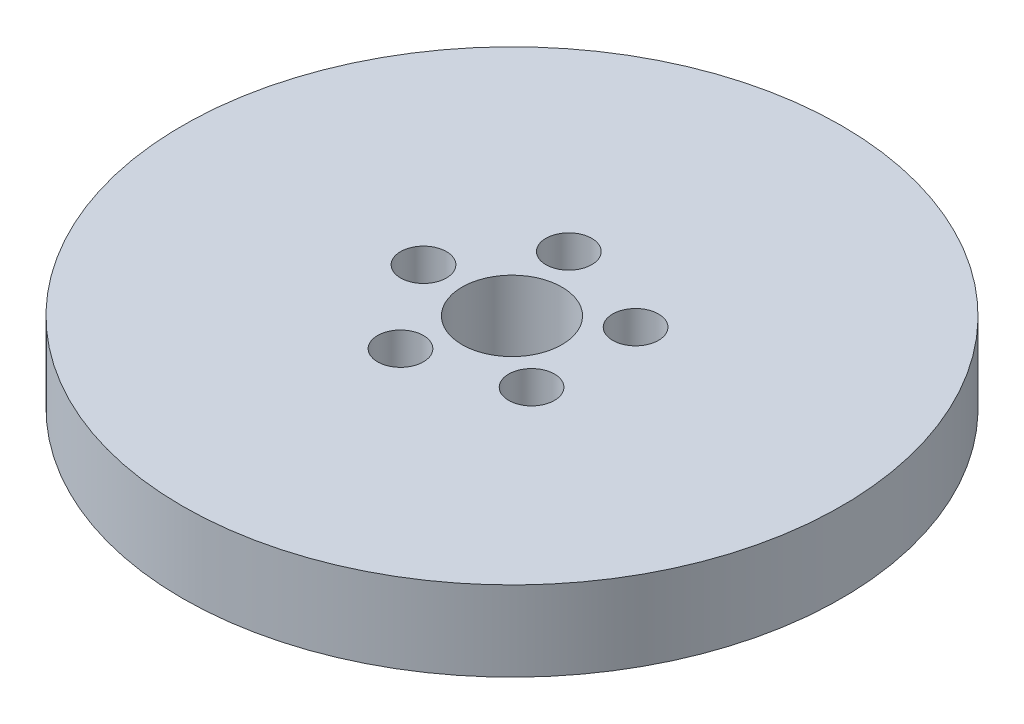
ISO-10303-21;
HEADER;
FILE_DESCRIPTION(('STEP AP214'),'2;1');
FILE_NAME('part.step','',(''),(''),'','','');
FILE_SCHEMA(('AUTOMOTIVE_DESIGN { 1 0 10303 214 1 1 1 1 }'));
ENDSEC;
DATA;
#1=APPLICATION_CONTEXT('core data for automotive mechanical design processes');
#2=APPLICATION_PROTOCOL_DEFINITION('international standard','automotive_design',2000,#1);
#3=PRODUCT_CONTEXT('',#1,'mechanical');
#4=PRODUCT('Part','Part','',(#3));
#5=PRODUCT_RELATED_PRODUCT_CATEGORY('part','',(#4));
#6=PRODUCT_DEFINITION_FORMATION('','',#4);
#7=PRODUCT_DEFINITION_CONTEXT('part definition',#1,'design');
#8=PRODUCT_DEFINITION('design','',#6,#7);
#9=PRODUCT_DEFINITION_SHAPE('','',#8);
#10=(LENGTH_UNIT() NAMED_UNIT(*) SI_UNIT(.MILLI.,.METRE.));
#11=(NAMED_UNIT(*) PLANE_ANGLE_UNIT() SI_UNIT($,.RADIAN.));
#12=(NAMED_UNIT(*) SI_UNIT($,.STERADIAN.) SOLID_ANGLE_UNIT());
#13=UNCERTAINTY_MEASURE_WITH_UNIT(LENGTH_MEASURE(1.E-05),#10,'distance_accuracy_value','');
#14=(GEOMETRIC_REPRESENTATION_CONTEXT(3) GLOBAL_UNCERTAINTY_ASSIGNED_CONTEXT((#13)) GLOBAL_UNIT_ASSIGNED_CONTEXT((#10,
#11,#12)) REPRESENTATION_CONTEXT('',''));
#15=CARTESIAN_POINT('',(0.,0.,0.));
#16=DIRECTION('',(0.,0.,1.));
#17=DIRECTION('',(1.,0.,0.));
#18=AXIS2_PLACEMENT_3D('',#15,#16,#17);
#19=CARTESIAN_POINT('',(0.,20.,0.));
#20=DIRECTION('',(0.,-1.,0.));
#21=DIRECTION('',(0.,0.,-1.));
#22=AXIS2_PLACEMENT_3D('',#19,#20,#21);
#23=CYLINDRICAL_SURFACE('',#22,82.5);
#24=CARTESIAN_POINT('',(0.,20.,0.));
#25=DIRECTION('',(0.,1.,0.));
#26=DIRECTION('',(0.,0.,1.));
#27=AXIS2_PLACEMENT_3D('',#24,#25,#26);
#28=CIRCLE('',#27,82.5);
#29=CARTESIAN_POINT('',(0.,20.,82.5));
#30=VERTEX_POINT('',#29);
#31=EDGE_CURVE('E10',#30,#30,#28,.T.);
#32=ORIENTED_EDGE('',*,*,#31,.F.);
#33=EDGE_LOOP('',(#32));
#34=FACE_BOUND('',#33,.T.);
#35=CARTESIAN_POINT('',(0.,0.,0.));
#36=DIRECTION('',(0.,1.,0.));
#37=DIRECTION('',(0.,0.,1.));
#38=AXIS2_PLACEMENT_3D('',#35,#36,#37);
#39=CIRCLE('',#38,82.5);
#40=CARTESIAN_POINT('',(0.,0.,82.5));
#41=VERTEX_POINT('',#40);
#42=EDGE_CURVE('E37',#41,#41,#39,.T.);
#43=ORIENTED_EDGE('',*,*,#42,.T.);
#44=EDGE_LOOP('',(#43));
#45=FACE_BOUND('',#44,.T.);
#46=ADVANCED_FACE('F40',(#34,#45),#23,.T.);
#47=CARTESIAN_POINT('',(0.,20.,0.));
#48=DIRECTION('',(0.,1.,0.));
#49=DIRECTION('',(0.,0.,1.));
#50=AXIS2_PLACEMENT_3D('',#47,#48,#49);
#51=PLANE('',#50);
#52=CARTESIAN_POINT('',(-6.84496013408361,20.,-21.0666211172892));
#53=DIRECTION('',(0.,1.,0.));
#54=DIRECTION('',(-0.95105651629515,0.,0.309016994374958));
#55=AXIS2_PLACEMENT_3D('',#52,#53,#54);
#56=CIRCLE('',#55,5.73390825486435);
#57=CARTESIAN_POINT('',(-12.2982309437109,20.,-19.2947460223493));
#58=VERTEX_POINT('',#57);
#59=EDGE_CURVE('E70',#58,#58,#56,.T.);
#60=ORIENTED_EDGE('',*,*,#59,.F.);
#61=EDGE_LOOP('',(#60));
#62=FACE_BOUND('',#61,.T.);
#63=CARTESIAN_POINT('',(17.9203382826682,20.,-13.0198878786012));
#64=DIRECTION('',(0.,1.,0.));
#65=DIRECTION('',(-0.58778525229248,0.,-0.809016994374942));
#66=AXIS2_PLACEMENT_3D('',#63,#64,#65);
#67=CIRCLE('',#66,5.73390825486435);
#68=CARTESIAN_POINT('',(14.5500315724608,20.,-17.6587171009733));
#69=VERTEX_POINT('',#68);
#70=EDGE_CURVE('E71',#69,#69,#67,.T.);
#71=ORIENTED_EDGE('',*,*,#70,.F.);
#72=EDGE_LOOP('',(#71));
#73=FACE_BOUND('',#72,.T.);
#74=CARTESIAN_POINT('',(17.9203382826684,20.,13.019887878601));
#75=DIRECTION('',(0.,1.,0.));
#76=DIRECTION('',(0.587785252292469,0.,-0.809016994374951));
#77=AXIS2_PLACEMENT_3D('',#74,#75,#76);
#78=CIRCLE('',#77,5.73390825486435);
#79=CARTESIAN_POINT('',(21.2906449928757,20.,8.3810586562289));
#80=VERTEX_POINT('',#79);
#81=EDGE_CURVE('E78',#80,#80,#78,.T.);
#82=ORIENTED_EDGE('',*,*,#81,.F.);
#83=EDGE_LOOP('',(#82));
#84=FACE_BOUND('',#83,.T.);
#85=CARTESIAN_POINT('',(-6.84496013408331,20.,21.0666211172893));
#86=DIRECTION('',(0.,1.,0.));
#87=DIRECTION('',(0.951056516295155,0.,0.309016994374945));
#88=AXIS2_PLACEMENT_3D('',#85,#86,#87);
#89=CIRCLE('',#88,5.73390825486435);
#90=CARTESIAN_POINT('',(-1.391689324456,20.,22.8384962122292));
#91=VERTEX_POINT('',#90);
#92=EDGE_CURVE('E61',#91,#91,#89,.T.);
#93=ORIENTED_EDGE('',*,*,#92,.F.);
#94=EDGE_LOOP('',(#93));
#95=FACE_BOUND('',#94,.T.);
#96=CARTESIAN_POINT('',(-22.1507562971699,20.,0.));
#97=DIRECTION('',(0.,1.,0.));
#98=DIRECTION('',(0.,0.,1.));
#99=AXIS2_PLACEMENT_3D('',#96,#97,#98);
#100=CIRCLE('',#99,5.73390825486435);
#101=CARTESIAN_POINT('',(-22.1507562971699,20.,5.73390825486435));
#102=VERTEX_POINT('',#101);
#103=EDGE_CURVE('E54',#102,#102,#100,.T.);
#104=ORIENTED_EDGE('',*,*,#103,.F.);
#105=EDGE_LOOP('',(#104));
#106=FACE_BOUND('',#105,.T.);
#107=CARTESIAN_POINT('',(0.,20.,0.));
#108=DIRECTION('',(0.,1.,0.));
#109=DIRECTION('',(0.,0.,1.));
#110=AXIS2_PLACEMENT_3D('',#107,#108,#109);
#111=CIRCLE('',#110,12.5);
#112=CARTESIAN_POINT('',(0.,20.,12.5));
#113=VERTEX_POINT('',#112);
#114=EDGE_CURVE('E50',#113,#113,#111,.T.);
#115=ORIENTED_EDGE('',*,*,#114,.F.);
#116=EDGE_LOOP('',(#115));
#117=FACE_BOUND('',#116,.T.);
#118=ORIENTED_EDGE('',*,*,#31,.T.);
#119=EDGE_LOOP('',(#118));
#120=FACE_BOUND('',#119,.T.);
#121=ADVANCED_FACE('F94',(#62,#73,#84,#95,#106,#117,#120),#51,.T.);
#122=CARTESIAN_POINT('',(0.,0.,0.));
#123=DIRECTION('',(0.,1.,0.));
#124=DIRECTION('',(0.,0.,1.));
#125=AXIS2_PLACEMENT_3D('',#122,#123,#124);
#126=PLANE('',#125);
#127=CARTESIAN_POINT('',(0.,0.,0.));
#128=DIRECTION('',(0.,1.,0.));
#129=DIRECTION('',(0.,0.,1.));
#130=AXIS2_PLACEMENT_3D('',#127,#128,#129);
#131=CIRCLE('',#130,12.5);
#132=CARTESIAN_POINT('',(0.,0.,12.5));
#133=VERTEX_POINT('',#132);
#134=EDGE_CURVE('E47',#133,#133,#131,.T.);
#135=ORIENTED_EDGE('',*,*,#134,.T.);
#136=EDGE_LOOP('',(#135));
#137=FACE_BOUND('',#136,.T.);
#138=ORIENTED_EDGE('',*,*,#42,.F.);
#139=EDGE_LOOP('',(#138));
#140=FACE_BOUND('',#139,.T.);
#141=ADVANCED_FACE('F100',(#137,#140),#126,.F.);
#142=CARTESIAN_POINT('',(0.,20.,0.));
#143=DIRECTION('',(0.,-1.,0.));
#144=DIRECTION('',(0.,0.,-1.));
#145=AXIS2_PLACEMENT_3D('',#142,#143,#144);
#146=CYLINDRICAL_SURFACE('',#145,12.5);
#147=ORIENTED_EDGE('',*,*,#114,.T.);
#148=EDGE_LOOP('',(#147));
#149=FACE_BOUND('',#148,.T.);
#150=ORIENTED_EDGE('',*,*,#134,.F.);
#151=EDGE_LOOP('',(#150));
#152=FACE_BOUND('',#151,.T.);
#153=ADVANCED_FACE('F106',(#149,#152),#146,.F.);
#154=CARTESIAN_POINT('',(-22.1507562971699,4.10353387351066,0.));
#155=DIRECTION('',(0.,1.,0.));
#156=DIRECTION('',(0.,0.,1.));
#157=AXIS2_PLACEMENT_3D('',#154,#155,#156);
#158=CYLINDRICAL_SURFACE('',#157,5.73390825486435);
#159=CARTESIAN_POINT('',(-22.1507562971699,4.10353387351066,0.));
#160=DIRECTION('',(0.,1.,0.));
#161=DIRECTION('',(0.,0.,1.));
#162=AXIS2_PLACEMENT_3D('',#159,#160,#161);
#163=CIRCLE('',#162,5.73390825486435);
#164=CARTESIAN_POINT('',(-22.1507562971699,4.10353387351066,5.73390825486435));
#165=VERTEX_POINT('',#164);
#166=EDGE_CURVE('E55',#165,#165,#163,.T.);
#167=ORIENTED_EDGE('',*,*,#166,.F.);
#168=EDGE_LOOP('',(#167));
#169=FACE_BOUND('',#168,.T.);
#170=ORIENTED_EDGE('',*,*,#103,.T.);
#171=EDGE_LOOP('',(#170));
#172=FACE_BOUND('',#171,.T.);
#173=ADVANCED_FACE('F108',(#169,#172),#158,.F.);
#174=CARTESIAN_POINT('',(-22.1507562971699,4.10353387351066,0.));
#175=DIRECTION('',(0.,1.,0.));
#176=DIRECTION('',(0.,0.,1.));
#177=AXIS2_PLACEMENT_3D('',#174,#175,#176);
#178=PLANE('',#177);
#179=ORIENTED_EDGE('',*,*,#166,.T.);
#180=EDGE_LOOP('',(#179));
#181=FACE_BOUND('',#180,.T.);
#182=ADVANCED_FACE('F138',(#181),#178,.T.);
#183=CARTESIAN_POINT('',(-6.84496013408331,4.10353387351066,21.0666211172893));
#184=DIRECTION('',(0.,1.,0.));
#185=DIRECTION('',(0.,0.,1.));
#186=AXIS2_PLACEMENT_3D('',#183,#184,#185);
#187=CYLINDRICAL_SURFACE('',#186,5.73390825486435);
#188=CARTESIAN_POINT('',(-6.84496013408331,4.10353387351066,21.0666211172893));
#189=DIRECTION('',(0.,1.,0.));
#190=DIRECTION('',(0.951056516295155,0.,0.309016994374945));
#191=AXIS2_PLACEMENT_3D('',#188,#189,#190);
#192=CIRCLE('',#191,5.73390825486435);
#193=CARTESIAN_POINT('',(-1.391689324456,4.10353387351066,22.8384962122292));
#194=VERTEX_POINT('',#193);
#195=EDGE_CURVE('E59',#194,#194,#192,.T.);
#196=ORIENTED_EDGE('',*,*,#195,.F.);
#197=EDGE_LOOP('',(#196));
#198=FACE_BOUND('',#197,.T.);
#199=ORIENTED_EDGE('',*,*,#92,.T.);
#200=EDGE_LOOP('',(#199));
#201=FACE_BOUND('',#200,.T.);
#202=ADVANCED_FACE('F150',(#198,#201),#187,.F.);
#203=CARTESIAN_POINT('',(-6.84496013408331,4.10353387351066,21.0666211172893));
#204=DIRECTION('',(0.,1.,0.));
#205=DIRECTION('',(0.951056516295155,0.,0.309016994374945));
#206=AXIS2_PLACEMENT_3D('',#203,#204,#205);
#207=PLANE('',#206);
#208=ORIENTED_EDGE('',*,*,#195,.T.);
#209=EDGE_LOOP('',(#208));
#210=FACE_BOUND('',#209,.T.);
#211=ADVANCED_FACE('F89',(#210),#207,.T.);
#212=CARTESIAN_POINT('',(17.9203382826684,4.10353387351066,13.019887878601));
#213=DIRECTION('',(0.,1.,0.));
#214=DIRECTION('',(0.,0.,1.));
#215=AXIS2_PLACEMENT_3D('',#212,#213,#214);
#216=CYLINDRICAL_SURFACE('',#215,5.73390825486435);
#217=CARTESIAN_POINT('',(17.9203382826684,4.10353387351066,13.019887878601));
#218=DIRECTION('',(0.,1.,0.));
#219=DIRECTION('',(0.587785252292469,0.,-0.809016994374951));
#220=AXIS2_PLACEMENT_3D('',#217,#218,#219);
#221=CIRCLE('',#220,5.73390825486435);
#222=CARTESIAN_POINT('',(21.2906449928757,4.10353387351066,8.3810586562289));
#223=VERTEX_POINT('',#222);
#224=EDGE_CURVE('E63',#223,#223,#221,.T.);
#225=ORIENTED_EDGE('',*,*,#224,.F.);
#226=EDGE_LOOP('',(#225));
#227=FACE_BOUND('',#226,.T.);
#228=ORIENTED_EDGE('',*,*,#81,.T.);
#229=EDGE_LOOP('',(#228));
#230=FACE_BOUND('',#229,.T.);
#231=ADVANCED_FACE('F87',(#227,#230),#216,.F.);
#232=CARTESIAN_POINT('',(17.9203382826684,4.10353387351066,13.019887878601));
#233=DIRECTION('',(0.,1.,0.));
#234=DIRECTION('',(0.587785252292469,0.,-0.809016994374951));
#235=AXIS2_PLACEMENT_3D('',#232,#233,#234);
#236=PLANE('',#235);
#237=ORIENTED_EDGE('',*,*,#224,.T.);
#238=EDGE_LOOP('',(#237));
#239=FACE_BOUND('',#238,.T.);
#240=ADVANCED_FACE('F84',(#239),#236,.T.);
#241=CARTESIAN_POINT('',(17.9203382826682,4.10353387351066,-13.0198878786012));
#242=DIRECTION('',(0.,1.,0.));
#243=DIRECTION('',(0.,0.,1.));
#244=AXIS2_PLACEMENT_3D('',#241,#242,#243);
#245=CYLINDRICAL_SURFACE('',#244,5.73390825486435);
#246=CARTESIAN_POINT('',(17.9203382826682,4.10353387351066,-13.0198878786012));
#247=DIRECTION('',(0.,1.,0.));
#248=DIRECTION('',(-0.58778525229248,0.,-0.809016994374942));
#249=AXIS2_PLACEMENT_3D('',#246,#247,#248);
#250=CIRCLE('',#249,5.73390825486435);
#251=CARTESIAN_POINT('',(14.5500315724608,4.10353387351066,-17.6587171009733));
#252=VERTEX_POINT('',#251);
#253=EDGE_CURVE('E76',#252,#252,#250,.T.);
#254=ORIENTED_EDGE('',*,*,#253,.F.);
#255=EDGE_LOOP('',(#254));
#256=FACE_BOUND('',#255,.T.);
#257=ORIENTED_EDGE('',*,*,#70,.T.);
#258=EDGE_LOOP('',(#257));
#259=FACE_BOUND('',#258,.T.);
#260=ADVANCED_FACE('F185',(#256,#259),#245,.F.);
#261=CARTESIAN_POINT('',(17.9203382826682,4.10353387351066,-13.0198878786012));
#262=DIRECTION('',(0.,1.,0.));
#263=DIRECTION('',(-0.58778525229248,0.,-0.809016994374942));
#264=AXIS2_PLACEMENT_3D('',#261,#262,#263);
#265=PLANE('',#264);
#266=ORIENTED_EDGE('',*,*,#253,.T.);
#267=EDGE_LOOP('',(#266));
#268=FACE_BOUND('',#267,.T.);
#269=ADVANCED_FACE('F189',(#268),#265,.T.);
#270=CARTESIAN_POINT('',(-6.84496013408361,4.10353387351066,-21.0666211172892));
#271=DIRECTION('',(0.,1.,0.));
#272=DIRECTION('',(0.,0.,1.));
#273=AXIS2_PLACEMENT_3D('',#270,#271,#272);
#274=CYLINDRICAL_SURFACE('',#273,5.73390825486435);
#275=CARTESIAN_POINT('',(-6.84496013408361,4.10353387351066,-21.0666211172892));
#276=DIRECTION('',(0.,1.,0.));
#277=DIRECTION('',(-0.95105651629515,0.,0.309016994374958));
#278=AXIS2_PLACEMENT_3D('',#275,#276,#277);
#279=CIRCLE('',#278,5.73390825486435);
#280=CARTESIAN_POINT('',(-12.2982309437109,4.10353387351066,-19.2947460223493));
#281=VERTEX_POINT('',#280);
#282=EDGE_CURVE('E69',#281,#281,#279,.T.);
#283=ORIENTED_EDGE('',*,*,#282,.F.);
#284=EDGE_LOOP('',(#283));
#285=FACE_BOUND('',#284,.T.);
#286=ORIENTED_EDGE('',*,*,#59,.T.);
#287=EDGE_LOOP('',(#286));
#288=FACE_BOUND('',#287,.T.);
#289=ADVANCED_FACE('F200',(#285,#288),#274,.F.);
#290=CARTESIAN_POINT('',(-6.84496013408361,4.10353387351066,-21.0666211172892));
#291=DIRECTION('',(0.,1.,0.));
#292=DIRECTION('',(-0.95105651629515,0.,0.309016994374958));
#293=AXIS2_PLACEMENT_3D('',#290,#291,#292);
#294=PLANE('',#293);
#295=ORIENTED_EDGE('',*,*,#282,.T.);
#296=EDGE_LOOP('',(#295));
#297=FACE_BOUND('',#296,.T.);
#298=ADVANCED_FACE('F208',(#297),#294,.T.);
#299=CLOSED_SHELL('',(#46,#121,#141,#153,#173,#182,#202,#211,#231,#240,#260,#269,#289,#298));
#300=MANIFOLD_SOLID_BREP('B2',#299);
#301=ADVANCED_BREP_SHAPE_REPRESENTATION('',(#18,#300),#14);
#302=SHAPE_DEFINITION_REPRESENTATION(#9,#301);
ENDSEC;
END-ISO-10303-21;
